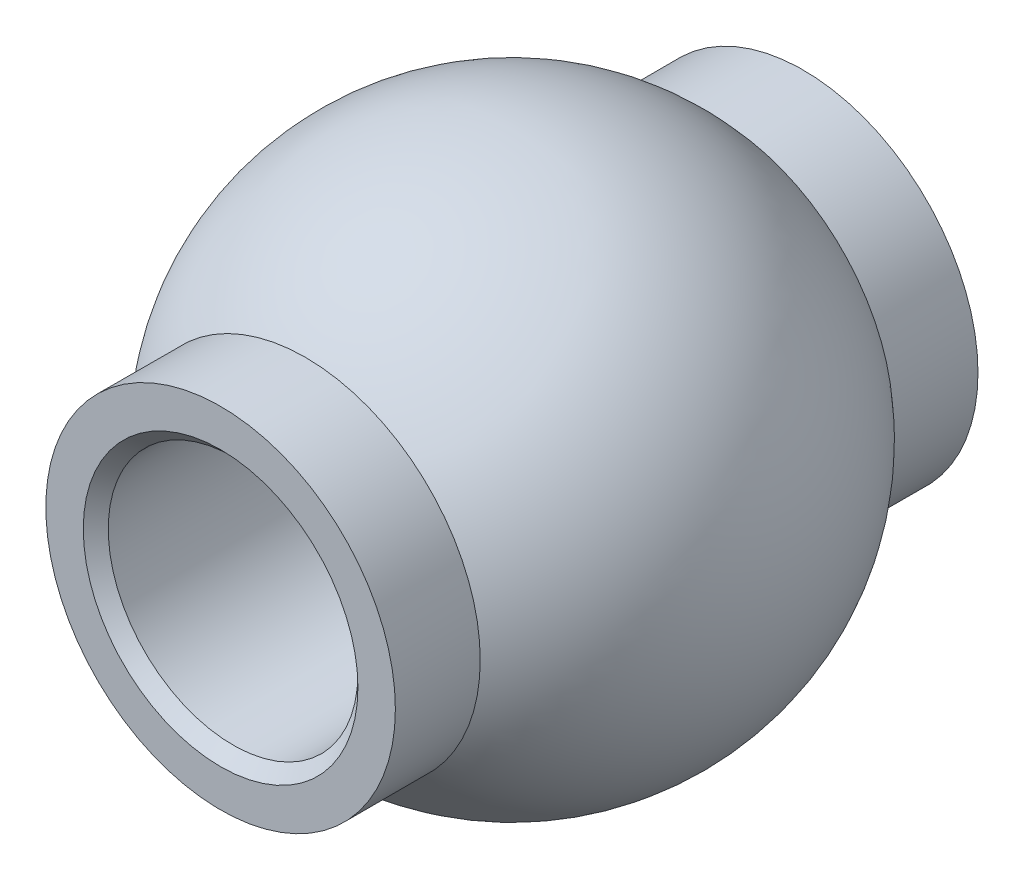
ISO-10303-21;
HEADER;
FILE_DESCRIPTION(('STEP AP214'),'2;1');
FILE_NAME('part.step','',(''),(''),'','','');
FILE_SCHEMA(('AUTOMOTIVE_DESIGN { 1 0 10303 214 1 1 1 1 }'));
ENDSEC;
DATA;
#1=APPLICATION_CONTEXT('core data for automotive mechanical design processes');
#2=APPLICATION_PROTOCOL_DEFINITION('international standard','automotive_design',2000,#1);
#3=PRODUCT_CONTEXT('',#1,'mechanical');
#4=PRODUCT('Part','Part','',(#3));
#5=PRODUCT_RELATED_PRODUCT_CATEGORY('part','',(#4));
#6=PRODUCT_DEFINITION_FORMATION('','',#4);
#7=PRODUCT_DEFINITION_CONTEXT('part definition',#1,'design');
#8=PRODUCT_DEFINITION('design','',#6,#7);
#9=PRODUCT_DEFINITION_SHAPE('','',#8);
#10=(LENGTH_UNIT() NAMED_UNIT(*) SI_UNIT(.MILLI.,.METRE.));
#11=(NAMED_UNIT(*) PLANE_ANGLE_UNIT() SI_UNIT($,.RADIAN.));
#12=(NAMED_UNIT(*) SI_UNIT($,.STERADIAN.) SOLID_ANGLE_UNIT());
#13=UNCERTAINTY_MEASURE_WITH_UNIT(LENGTH_MEASURE(1.E-05),#10,'distance_accuracy_value','');
#14=(GEOMETRIC_REPRESENTATION_CONTEXT(3) GLOBAL_UNCERTAINTY_ASSIGNED_CONTEXT((#13)) GLOBAL_UNIT_ASSIGNED_CONTEXT((#10,
#11,#12)) REPRESENTATION_CONTEXT('',''));
#15=CARTESIAN_POINT('',(0.,0.,0.));
#16=DIRECTION('',(0.,0.,1.));
#17=DIRECTION('',(1.,0.,0.));
#18=AXIS2_PLACEMENT_3D('',#15,#16,#17);
#19=CARTESIAN_POINT('',(0.,19.05,0.));
#20=DIRECTION('',(0.,-1.,0.));
#21=DIRECTION('',(-1.,0.,0.));
#22=AXIS2_PLACEMENT_3D('',#19,#20,#21);
#23=SPHERICAL_SURFACE('',#22,10.31875);
#24=CARTESIAN_POINT('',(0.,19.05,0.));
#25=DIRECTION('',(0.,0.,-1.));
#26=DIRECTION('',(-1.,0.,0.));
#27=AXIS2_PLACEMENT_3D('',#24,#25,#26);
#28=SPHERICAL_SURFACE('',#27,10.31875);
#29=CARTESIAN_POINT('',(0.,19.05,7.87534413930591));
#30=DIRECTION('',(0.,0.,-1.));
#31=DIRECTION('',(-1.,0.,0.));
#32=AXIS2_PLACEMENT_3D('',#29,#30,#31);
#33=CIRCLE('',#32,6.6675);
#34=CARTESIAN_POINT('',(-6.66750000000001,19.05,7.87534413930591));
#35=VERTEX_POINT('',#34);
#36=EDGE_CURVE('E56',#35,#35,#33,.F.);
#37=ORIENTED_EDGE('',*,*,#36,.F.);
#38=EDGE_LOOP('',(#37));
#39=FACE_BOUND('',#38,.T.);
#40=CARTESIAN_POINT('',(0.,19.05,-7.87534413930591));
#41=DIRECTION('',(0.,0.,1.));
#42=DIRECTION('',(1.,0.,0.));
#43=AXIS2_PLACEMENT_3D('',#40,#41,#42);
#44=CIRCLE('',#43,6.6675);
#45=CARTESIAN_POINT('',(6.66749999999999,19.05,-7.87534413930591));
#46=VERTEX_POINT('',#45);
#47=EDGE_CURVE('E59',#46,#46,#44,.F.);
#48=ORIENTED_EDGE('',*,*,#47,.F.);
#49=EDGE_LOOP('',(#48));
#50=FACE_BOUND('',#49,.T.);
#51=ADVANCED_FACE('F36',(#39,#50),#28,.T.);
#52=CARTESIAN_POINT('',(0.,19.05,-11.1125));
#53=DIRECTION('',(0.,0.,1.));
#54=DIRECTION('',(1.,0.,0.));
#55=AXIS2_PLACEMENT_3D('',#52,#53,#54);
#56=CYLINDRICAL_SURFACE('',#55,6.6675);
#57=ORIENTED_EDGE('',*,*,#47,.T.);
#58=EDGE_LOOP('',(#57));
#59=FACE_BOUND('',#58,.T.);
#60=CARTESIAN_POINT('',(0.,19.05,-11.1125));
#61=DIRECTION('',(0.,0.,1.));
#62=DIRECTION('',(1.,0.,0.));
#63=AXIS2_PLACEMENT_3D('',#60,#61,#62);
#64=CIRCLE('',#63,6.6675);
#65=CARTESIAN_POINT('',(6.66749999999999,19.05,-11.1125));
#66=VERTEX_POINT('',#65);
#67=EDGE_CURVE('E62',#66,#66,#64,.T.);
#68=ORIENTED_EDGE('',*,*,#67,.T.);
#69=EDGE_LOOP('',(#68));
#70=FACE_BOUND('',#69,.T.);
#71=ADVANCED_FACE('F76',(#59,#70),#56,.T.);
#72=CARTESIAN_POINT('',(0.,19.05,-11.1125));
#73=DIRECTION('',(0.,0.,1.));
#74=DIRECTION('',(1.,0.,0.));
#75=AXIS2_PLACEMENT_3D('',#72,#73,#74);
#76=PLANE('',#75);
#77=CARTESIAN_POINT('',(0.,19.05,-11.1125));
#78=DIRECTION('',(0.,0.,1.));
#79=DIRECTION('',(1.,0.,0.));
#80=AXIS2_PLACEMENT_3D('',#77,#78,#79);
#81=CIRCLE('',#80,5.23875);
#82=CARTESIAN_POINT('',(5.23874999999999,19.05,-11.1125));
#83=VERTEX_POINT('',#82);
#84=EDGE_CURVE('E51',#83,#83,#81,.T.);
#85=ORIENTED_EDGE('',*,*,#84,.T.);
#86=EDGE_LOOP('',(#85));
#87=FACE_BOUND('',#86,.T.);
#88=ORIENTED_EDGE('',*,*,#67,.F.);
#89=EDGE_LOOP('',(#88));
#90=FACE_BOUND('',#89,.T.);
#91=ADVANCED_FACE('F73',(#87,#90),#76,.F.);
#92=ORIENTED_EDGE('',*,*,#36,.T.);
#93=EDGE_LOOP('',(#92));
#94=FACE_BOUND('',#93,.T.);
#95=CARTESIAN_POINT('',(0.,19.05,11.1125));
#96=DIRECTION('',(0.,0.,1.));
#97=DIRECTION('',(1.,0.,0.));
#98=AXIS2_PLACEMENT_3D('',#95,#96,#97);
#99=CIRCLE('',#98,6.6675);
#100=CARTESIAN_POINT('',(6.66749999999999,19.05,11.1125));
#101=VERTEX_POINT('',#100);
#102=EDGE_CURVE('E65',#101,#101,#99,.T.);
#103=ORIENTED_EDGE('',*,*,#102,.F.);
#104=EDGE_LOOP('',(#103));
#105=FACE_BOUND('',#104,.T.);
#106=ADVANCED_FACE('F71',(#94,#105),#56,.T.);
#107=CARTESIAN_POINT('',(0.,19.05,11.1125));
#108=DIRECTION('',(0.,0.,1.));
#109=DIRECTION('',(1.,0.,0.));
#110=AXIS2_PLACEMENT_3D('',#107,#108,#109);
#111=PLANE('',#110);
#112=CARTESIAN_POINT('',(0.,19.05,11.1125));
#113=DIRECTION('',(0.,0.,1.));
#114=DIRECTION('',(1.,0.,0.));
#115=AXIS2_PLACEMENT_3D('',#112,#113,#114);
#116=CIRCLE('',#115,5.23875);
#117=CARTESIAN_POINT('',(5.23874999999999,19.05,11.1125));
#118=VERTEX_POINT('',#117);
#119=EDGE_CURVE('E10',#118,#118,#116,.F.);
#120=ORIENTED_EDGE('',*,*,#119,.T.);
#121=EDGE_LOOP('',(#120));
#122=FACE_BOUND('',#121,.T.);
#123=ORIENTED_EDGE('',*,*,#102,.T.);
#124=EDGE_LOOP('',(#123));
#125=FACE_BOUND('',#124,.T.);
#126=ADVANCED_FACE('F69',(#122,#125),#111,.T.);
#127=CARTESIAN_POINT('',(0.,19.05,-10.31875));
#128=DIRECTION('',(0.,0.,1.));
#129=DIRECTION('',(1.,0.,0.));
#130=AXIS2_PLACEMENT_3D('',#127,#128,#129);
#131=CYLINDRICAL_SURFACE('',#130,4.7625);
#132=CARTESIAN_POINT('',(0.,19.05,-10.63625));
#133=DIRECTION('',(0.,0.,1.));
#134=DIRECTION('',(1.,0.,0.));
#135=AXIS2_PLACEMENT_3D('',#132,#133,#134);
#136=CIRCLE('',#135,4.7625);
#137=CARTESIAN_POINT('',(4.76249999999999,19.05,-10.63625));
#138=VERTEX_POINT('',#137);
#139=EDGE_CURVE('E43',#138,#138,#136,.F.);
#140=ORIENTED_EDGE('',*,*,#139,.T.);
#141=EDGE_LOOP('',(#140));
#142=FACE_BOUND('',#141,.T.);
#143=CARTESIAN_POINT('',(0.,19.05,10.63625));
#144=DIRECTION('',(0.,0.,1.));
#145=DIRECTION('',(1.,0.,0.));
#146=AXIS2_PLACEMENT_3D('',#143,#144,#145);
#147=CIRCLE('',#146,4.7625);
#148=CARTESIAN_POINT('',(4.76249999999999,19.05,10.63625));
#149=VERTEX_POINT('',#148);
#150=EDGE_CURVE('E47',#149,#149,#147,.T.);
#151=ORIENTED_EDGE('',*,*,#150,.T.);
#152=EDGE_LOOP('',(#151));
#153=FACE_BOUND('',#152,.T.);
#154=ADVANCED_FACE('F81',(#142,#153),#131,.F.);
#155=CARTESIAN_POINT('',(0.,19.05,-11.1125));
#156=DIRECTION('',(0.,0.,-1.));
#157=DIRECTION('',(-1.,0.,0.));
#158=AXIS2_PLACEMENT_3D('',#155,#156,#157);
#159=CONICAL_SURFACE('',#158,5.23875,0.785398163397447);
#160=ORIENTED_EDGE('',*,*,#139,.F.);
#161=EDGE_LOOP('',(#160));
#162=FACE_BOUND('',#161,.T.);
#163=ORIENTED_EDGE('',*,*,#84,.F.);
#164=EDGE_LOOP('',(#163));
#165=FACE_BOUND('',#164,.T.);
#166=ADVANCED_FACE('F95',(#162,#165),#159,.F.);
#167=CARTESIAN_POINT('',(0.,19.05,10.63625));
#168=DIRECTION('',(0.,0.,1.));
#169=DIRECTION('',(1.,0.,0.));
#170=AXIS2_PLACEMENT_3D('',#167,#168,#169);
#171=CONICAL_SURFACE('',#170,4.7625,0.78539816339745);
#172=ORIENTED_EDGE('',*,*,#119,.F.);
#173=EDGE_LOOP('',(#172));
#174=FACE_BOUND('',#173,.T.);
#175=ORIENTED_EDGE('',*,*,#150,.F.);
#176=EDGE_LOOP('',(#175));
#177=FACE_BOUND('',#176,.T.);
#178=ADVANCED_FACE('F38',(#174,#177),#171,.F.);
#179=CLOSED_SHELL('',(#51,#71,#91,#106,#126,#154,#166,#178));
#180=MANIFOLD_SOLID_BREP('B2',#179);
#181=ADVANCED_BREP_SHAPE_REPRESENTATION('',(#18,#180),#14);
#182=SHAPE_DEFINITION_REPRESENTATION(#9,#181);
ENDSEC;
END-ISO-10303-21;
